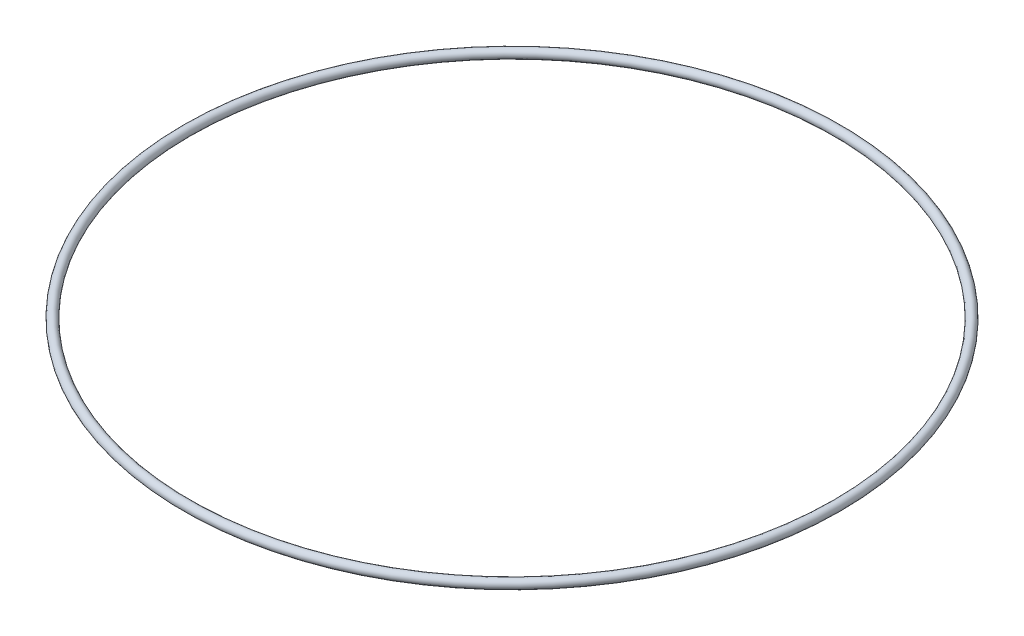
ISO-10303-21;
HEADER;
FILE_DESCRIPTION(('STEP AP214'),'2;1');
FILE_NAME('part.step','',(''),(''),'','','');
FILE_SCHEMA(('AUTOMOTIVE_DESIGN { 1 0 10303 214 1 1 1 1 }'));
ENDSEC;
DATA;
#1=APPLICATION_CONTEXT('core data for automotive mechanical design processes');
#2=APPLICATION_PROTOCOL_DEFINITION('international standard','automotive_design',2000,#1);
#3=PRODUCT_CONTEXT('',#1,'mechanical');
#4=PRODUCT('Part','Part','',(#3));
#5=PRODUCT_RELATED_PRODUCT_CATEGORY('part','',(#4));
#6=PRODUCT_DEFINITION_FORMATION('','',#4);
#7=PRODUCT_DEFINITION_CONTEXT('part definition',#1,'design');
#8=PRODUCT_DEFINITION('design','',#6,#7);
#9=PRODUCT_DEFINITION_SHAPE('','',#8);
#10=(LENGTH_UNIT() NAMED_UNIT(*) SI_UNIT(.MILLI.,.METRE.));
#11=(NAMED_UNIT(*) PLANE_ANGLE_UNIT() SI_UNIT($,.RADIAN.));
#12=(NAMED_UNIT(*) SI_UNIT($,.STERADIAN.) SOLID_ANGLE_UNIT());
#13=UNCERTAINTY_MEASURE_WITH_UNIT(LENGTH_MEASURE(1.E-05),#10,'distance_accuracy_value','');
#14=(GEOMETRIC_REPRESENTATION_CONTEXT(3) GLOBAL_UNCERTAINTY_ASSIGNED_CONTEXT((#13)) GLOBAL_UNIT_ASSIGNED_CONTEXT((#10,
#11,#12)) REPRESENTATION_CONTEXT('',''));
#15=CARTESIAN_POINT('',(0.,0.,0.));
#16=DIRECTION('',(0.,0.,1.));
#17=DIRECTION('',(1.,0.,0.));
#18=AXIS2_PLACEMENT_3D('',#15,#16,#17);
#19=CARTESIAN_POINT('',(0.,3.17499999999999,0.));
#20=DIRECTION('',(0.,-1.,0.));
#21=DIRECTION('',(1.,0.,0.));
#22=AXIS2_PLACEMENT_3D('',#19,#20,#21);
#23=TOROIDAL_SURFACE('',#22,56.515,0.79375);
#24=CARTESIAN_POINT('',(57.30875,3.175,0.));
#25=VERTEX_POINT('',#24);
#26=VERTEX_LOOP('',#25);
#27=FACE_BOUND('',#26,.T.);
#28=ADVANCED_FACE('F29',(#27),#23,.T.);
#29=CLOSED_SHELL('',(#28));
#30=MANIFOLD_SOLID_BREP('B2',#29);
#31=ADVANCED_BREP_SHAPE_REPRESENTATION('',(#18,#30),#14);
#32=SHAPE_DEFINITION_REPRESENTATION(#9,#31);
ENDSEC;
END-ISO-10303-21;
